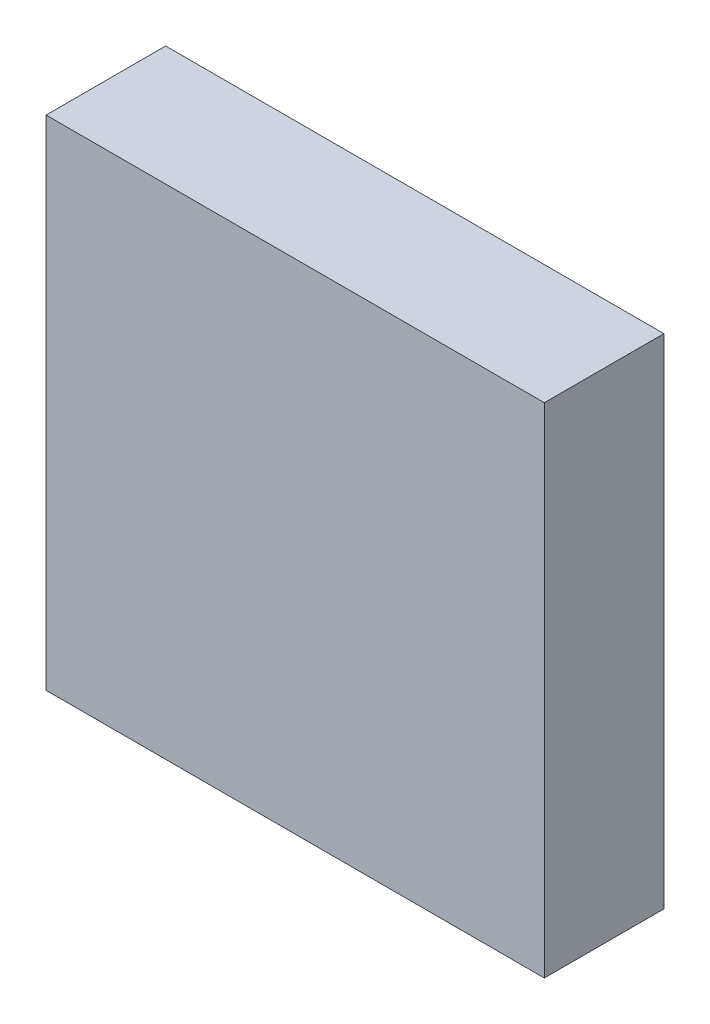
ISO-10303-21;
HEADER;
FILE_DESCRIPTION(('STEP AP214'),'2;1');
FILE_NAME('part.step','',(''),(''),'','','');
FILE_SCHEMA(('AUTOMOTIVE_DESIGN { 1 0 10303 214 1 1 1 1 }'));
ENDSEC;
DATA;
#1=APPLICATION_CONTEXT('core data for automotive mechanical design processes');
#2=APPLICATION_PROTOCOL_DEFINITION('international standard','automotive_design',2000,#1);
#3=PRODUCT_CONTEXT('',#1,'mechanical');
#4=PRODUCT('Part','Part','',(#3));
#5=PRODUCT_RELATED_PRODUCT_CATEGORY('part','',(#4));
#6=PRODUCT_DEFINITION_FORMATION('','',#4);
#7=PRODUCT_DEFINITION_CONTEXT('part definition',#1,'design');
#8=PRODUCT_DEFINITION('design','',#6,#7);
#9=PRODUCT_DEFINITION_SHAPE('','',#8);
#10=(LENGTH_UNIT() NAMED_UNIT(*) SI_UNIT(.MILLI.,.METRE.));
#11=(NAMED_UNIT(*) PLANE_ANGLE_UNIT() SI_UNIT($,.RADIAN.));
#12=(NAMED_UNIT(*) SI_UNIT($,.STERADIAN.) SOLID_ANGLE_UNIT());
#13=UNCERTAINTY_MEASURE_WITH_UNIT(LENGTH_MEASURE(1.E-05),#10,'distance_accuracy_value','');
#14=(GEOMETRIC_REPRESENTATION_CONTEXT(3) GLOBAL_UNCERTAINTY_ASSIGNED_CONTEXT((#13)) GLOBAL_UNIT_ASSIGNED_CONTEXT((#10,
#11,#12)) REPRESENTATION_CONTEXT('',''));
#15=CARTESIAN_POINT('',(0.,0.,0.));
#16=DIRECTION('',(0.,0.,1.));
#17=DIRECTION('',(1.,0.,0.));
#18=AXIS2_PLACEMENT_3D('',#15,#16,#17);
#19=CARTESIAN_POINT('',(0.,0.,3.));
#20=DIRECTION('',(1.,0.,0.));
#21=DIRECTION('',(0.,1.,0.));
#22=AXIS2_PLACEMENT_3D('',#19,#20,#21);
#23=PLANE('',#22);
#24=DIRECTION('',(0.,-1.,0.));
#25=VECTOR('',#24,1.);
#26=CARTESIAN_POINT('',(0.,0.,0.));
#27=LINE('',#26,#25);
#28=CARTESIAN_POINT('',(0.,12.5,0.));
#29=VERTEX_POINT('',#28);
#30=CARTESIAN_POINT('',(0.,0.,0.));
#31=VERTEX_POINT('',#30);
#32=EDGE_CURVE('E11',#29,#31,#27,.T.);
#33=ORIENTED_EDGE('',*,*,#32,.T.);
#34=DIRECTION('',(0.,0.,-1.));
#35=VECTOR('',#34,1.);
#36=CARTESIAN_POINT('',(0.,0.,3.));
#37=LINE('',#36,#35);
#38=CARTESIAN_POINT('',(0.,0.,3.));
#39=VERTEX_POINT('',#38);
#40=EDGE_CURVE('E42',#39,#31,#37,.T.);
#41=ORIENTED_EDGE('',*,*,#40,.F.);
#42=DIRECTION('',(0.,-1.,0.));
#43=VECTOR('',#42,1.);
#44=CARTESIAN_POINT('',(0.,0.,3.));
#45=LINE('',#44,#43);
#46=CARTESIAN_POINT('',(0.,12.5,3.));
#47=VERTEX_POINT('',#46);
#48=EDGE_CURVE('E90',#47,#39,#45,.T.);
#49=ORIENTED_EDGE('',*,*,#48,.F.);
#50=DIRECTION('',(0.,0.,-1.));
#51=VECTOR('',#50,1.);
#52=CARTESIAN_POINT('',(0.,12.5,3.));
#53=LINE('',#52,#51);
#54=EDGE_CURVE('E27',#47,#29,#53,.T.);
#55=ORIENTED_EDGE('',*,*,#54,.T.);
#56=EDGE_LOOP('',(#33,#41,#49,#55));
#57=FACE_BOUND('',#56,.T.);
#58=ADVANCED_FACE('F16',(#57),#23,.F.);
#59=CARTESIAN_POINT('',(0.,0.,3.));
#60=DIRECTION('',(0.,1.,0.));
#61=DIRECTION('',(1.,0.,0.));
#62=AXIS2_PLACEMENT_3D('',#59,#60,#61);
#63=PLANE('',#62);
#64=DIRECTION('',(1.,0.,0.));
#65=VECTOR('',#64,1.);
#66=CARTESIAN_POINT('',(0.,0.,0.));
#67=LINE('',#66,#65);
#68=CARTESIAN_POINT('',(12.5,0.,0.));
#69=VERTEX_POINT('',#68);
#70=EDGE_CURVE('E116',#31,#69,#67,.T.);
#71=ORIENTED_EDGE('',*,*,#70,.T.);
#72=DIRECTION('',(0.,0.,-1.));
#73=VECTOR('',#72,1.);
#74=CARTESIAN_POINT('',(12.5,0.,3.));
#75=LINE('',#74,#73);
#76=CARTESIAN_POINT('',(12.5,0.,3.));
#77=VERTEX_POINT('',#76);
#78=EDGE_CURVE('E67',#77,#69,#75,.T.);
#79=ORIENTED_EDGE('',*,*,#78,.F.);
#80=DIRECTION('',(1.,0.,0.));
#81=VECTOR('',#80,1.);
#82=CARTESIAN_POINT('',(0.,0.,3.));
#83=LINE('',#82,#81);
#84=EDGE_CURVE('E74',#39,#77,#83,.T.);
#85=ORIENTED_EDGE('',*,*,#84,.F.);
#86=ORIENTED_EDGE('',*,*,#40,.T.);
#87=EDGE_LOOP('',(#71,#79,#85,#86));
#88=FACE_BOUND('',#87,.T.);
#89=ADVANCED_FACE('F122',(#88),#63,.F.);
#90=CARTESIAN_POINT('',(12.5,0.,3.));
#91=DIRECTION('',(-1.,0.,0.));
#92=DIRECTION('',(0.,0.,1.));
#93=AXIS2_PLACEMENT_3D('',#90,#91,#92);
#94=PLANE('',#93);
#95=DIRECTION('',(0.,1.,0.));
#96=VECTOR('',#95,1.);
#97=CARTESIAN_POINT('',(12.5,0.,0.));
#98=LINE('',#97,#96);
#99=CARTESIAN_POINT('',(12.5,12.5,0.));
#100=VERTEX_POINT('',#99);
#101=EDGE_CURVE('E92',#69,#100,#98,.T.);
#102=ORIENTED_EDGE('',*,*,#101,.T.);
#103=DIRECTION('',(0.,0.,-1.));
#104=VECTOR('',#103,1.);
#105=CARTESIAN_POINT('',(12.5,12.5,3.));
#106=LINE('',#105,#104);
#107=CARTESIAN_POINT('',(12.5,12.5,3.));
#108=VERTEX_POINT('',#107);
#109=EDGE_CURVE('E20',#108,#100,#106,.T.);
#110=ORIENTED_EDGE('',*,*,#109,.F.);
#111=DIRECTION('',(0.,1.,0.));
#112=VECTOR('',#111,1.);
#113=CARTESIAN_POINT('',(12.5,0.,3.));
#114=LINE('',#113,#112);
#115=EDGE_CURVE('E109',#77,#108,#114,.T.);
#116=ORIENTED_EDGE('',*,*,#115,.F.);
#117=ORIENTED_EDGE('',*,*,#78,.T.);
#118=EDGE_LOOP('',(#102,#110,#116,#117));
#119=FACE_BOUND('',#118,.T.);
#120=ADVANCED_FACE('F93',(#119),#94,.F.);
#121=CARTESIAN_POINT('',(0.,12.5,3.));
#122=DIRECTION('',(0.,-1.,0.));
#123=DIRECTION('',(0.,0.,-1.));
#124=AXIS2_PLACEMENT_3D('',#121,#122,#123);
#125=PLANE('',#124);
#126=DIRECTION('',(-1.,0.,0.));
#127=VECTOR('',#126,1.);
#128=CARTESIAN_POINT('',(0.,12.5,0.));
#129=LINE('',#128,#127);
#130=EDGE_CURVE('E86',#100,#29,#129,.T.);
#131=ORIENTED_EDGE('',*,*,#130,.T.);
#132=ORIENTED_EDGE('',*,*,#54,.F.);
#133=DIRECTION('',(-1.,0.,0.));
#134=VECTOR('',#133,1.);
#135=CARTESIAN_POINT('',(0.,12.5,3.));
#136=LINE('',#135,#134);
#137=EDGE_CURVE('E88',#108,#47,#136,.T.);
#138=ORIENTED_EDGE('',*,*,#137,.F.);
#139=ORIENTED_EDGE('',*,*,#109,.T.);
#140=EDGE_LOOP('',(#131,#132,#138,#139));
#141=FACE_BOUND('',#140,.T.);
#142=ADVANCED_FACE('F18',(#141),#125,.F.);
#143=CARTESIAN_POINT('',(0.,12.5,3.));
#144=DIRECTION('',(0.,0.,-1.));
#145=DIRECTION('',(0.,-1.,0.));
#146=AXIS2_PLACEMENT_3D('',#143,#144,#145);
#147=PLANE('',#146);
#148=ORIENTED_EDGE('',*,*,#48,.T.);
#149=ORIENTED_EDGE('',*,*,#84,.T.);
#150=ORIENTED_EDGE('',*,*,#115,.T.);
#151=ORIENTED_EDGE('',*,*,#137,.T.);
#152=EDGE_LOOP('',(#148,#149,#150,#151));
#153=FACE_BOUND('',#152,.T.);
#154=ADVANCED_FACE('F120',(#153),#147,.F.);
#155=CARTESIAN_POINT('',(0.,12.5,0.));
#156=DIRECTION('',(0.,0.,-1.));
#157=DIRECTION('',(0.,-1.,0.));
#158=AXIS2_PLACEMENT_3D('',#155,#156,#157);
#159=PLANE('',#158);
#160=ORIENTED_EDGE('',*,*,#32,.F.);
#161=ORIENTED_EDGE('',*,*,#130,.F.);
#162=ORIENTED_EDGE('',*,*,#101,.F.);
#163=ORIENTED_EDGE('',*,*,#70,.F.);
#164=EDGE_LOOP('',(#160,#161,#162,#163));
#165=FACE_BOUND('',#164,.T.);
#166=ADVANCED_FACE('F99',(#165),#159,.T.);
#167=CLOSED_SHELL('',(#58,#89,#120,#142,#154,#166));
#168=MANIFOLD_SOLID_BREP('B1',#167);
#169=ADVANCED_BREP_SHAPE_REPRESENTATION('',(#18,#168),#14);
#170=SHAPE_DEFINITION_REPRESENTATION(#9,#169);
ENDSEC;
END-ISO-10303-21;
